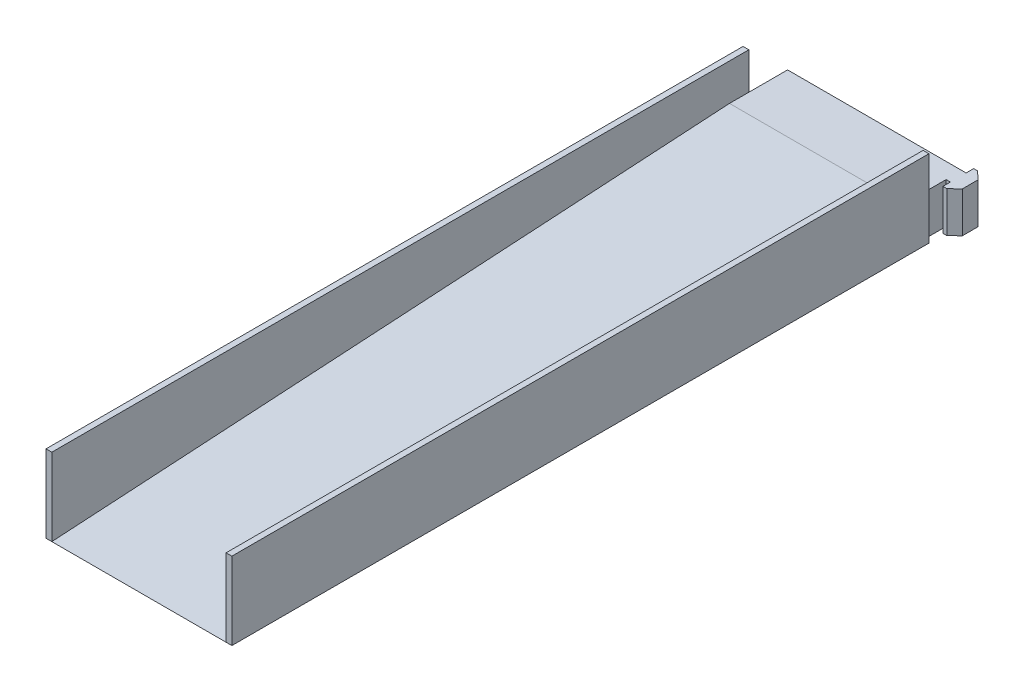
ISO-10303-21;
HEADER;
FILE_DESCRIPTION(('STEP AP214'),'2;1');
FILE_NAME('part.step','',(''),(''),'','','');
FILE_SCHEMA(('AUTOMOTIVE_DESIGN { 1 0 10303 214 1 1 1 1 }'));
ENDSEC;
DATA;
#1=APPLICATION_CONTEXT('core data for automotive mechanical design processes');
#2=APPLICATION_PROTOCOL_DEFINITION('international standard','automotive_design',2000,#1);
#3=PRODUCT_CONTEXT('',#1,'mechanical');
#4=PRODUCT('Part','Part','',(#3));
#5=PRODUCT_RELATED_PRODUCT_CATEGORY('part','',(#4));
#6=PRODUCT_DEFINITION_FORMATION('','',#4);
#7=PRODUCT_DEFINITION_CONTEXT('part definition',#1,'design');
#8=PRODUCT_DEFINITION('design','',#6,#7);
#9=PRODUCT_DEFINITION_SHAPE('','',#8);
#10=(LENGTH_UNIT() NAMED_UNIT(*) SI_UNIT(.MILLI.,.METRE.));
#11=(NAMED_UNIT(*) PLANE_ANGLE_UNIT() SI_UNIT($,.RADIAN.));
#12=(NAMED_UNIT(*) SI_UNIT($,.STERADIAN.) SOLID_ANGLE_UNIT());
#13=UNCERTAINTY_MEASURE_WITH_UNIT(LENGTH_MEASURE(1.E-05),#10,'distance_accuracy_value','');
#14=(GEOMETRIC_REPRESENTATION_CONTEXT(3) GLOBAL_UNCERTAINTY_ASSIGNED_CONTEXT((#13)) GLOBAL_UNIT_ASSIGNED_CONTEXT((#10,
#11,#12)) REPRESENTATION_CONTEXT('',''));
#15=CARTESIAN_POINT('',(0.,0.,0.));
#16=DIRECTION('',(0.,0.,1.));
#17=DIRECTION('',(1.,0.,0.));
#18=AXIS2_PLACEMENT_3D('',#15,#16,#17);
#19=CARTESIAN_POINT('',(45.,21.,0.));
#20=DIRECTION('',(-1.,0.,0.));
#21=DIRECTION('',(0.,0.,1.));
#22=AXIS2_PLACEMENT_3D('',#19,#20,#21);
#23=PLANE('',#22);
#24=DIRECTION('',(0.,-1.,0.));
#25=VECTOR('',#24,1.);
#26=CARTESIAN_POINT('',(45.,40.,-170.));
#27=LINE('',#26,#25);
#28=CARTESIAN_POINT('',(45.,21.,-170.));
#29=VERTEX_POINT('',#28);
#30=CARTESIAN_POINT('',(45.,0.,-170.));
#31=VERTEX_POINT('',#30);
#32=EDGE_CURVE('E67',#29,#31,#27,.T.);
#33=ORIENTED_EDGE('',*,*,#32,.T.);
#34=DIRECTION('',(0.,0.,-1.));
#35=VECTOR('',#34,1.);
#36=CARTESIAN_POINT('',(45.,0.,0.));
#37=LINE('',#36,#35);
#38=CARTESIAN_POINT('',(45.,0.,-181.9));
#39=VERTEX_POINT('',#38);
#40=EDGE_CURVE('E328',#31,#39,#37,.T.);
#41=ORIENTED_EDGE('',*,*,#40,.T.);
#42=DIRECTION('',(0.,-1.,0.));
#43=VECTOR('',#42,1.);
#44=CARTESIAN_POINT('',(45.,21.,-181.9));
#45=LINE('',#44,#43);
#46=CARTESIAN_POINT('',(45.,21.,-181.9));
#47=VERTEX_POINT('',#46);
#48=EDGE_CURVE('E48',#47,#39,#45,.T.);
#49=ORIENTED_EDGE('',*,*,#48,.F.);
#50=DIRECTION('',(0.,0.,-1.));
#51=VECTOR('',#50,1.);
#52=CARTESIAN_POINT('',(45.,21.,0.));
#53=LINE('',#52,#51);
#54=EDGE_CURVE('E62',#29,#47,#53,.T.);
#55=ORIENTED_EDGE('',*,*,#54,.F.);
#56=EDGE_LOOP('',(#33,#41,#49,#55));
#57=FACE_BOUND('',#56,.T.);
#58=ADVANCED_FACE('F45',(#57),#23,.F.);
#59=CARTESIAN_POINT('',(0.,21.,-181.9));
#60=DIRECTION('',(0.,0.,1.));
#61=DIRECTION('',(1.,0.,0.));
#62=AXIS2_PLACEMENT_3D('',#59,#60,#61);
#63=PLANE('',#62);
#64=DIRECTION('',(-1.,0.,0.));
#65=VECTOR('',#64,1.);
#66=CARTESIAN_POINT('',(0.,0.,-181.9));
#67=LINE('',#66,#65);
#68=CARTESIAN_POINT('',(47.2,0.,-181.9));
#69=VERTEX_POINT('',#68);
#70=EDGE_CURVE('E331',#69,#39,#67,.T.);
#71=ORIENTED_EDGE('',*,*,#70,.F.);
#72=DIRECTION('',(0.,-1.,0.));
#73=VECTOR('',#72,1.);
#74=CARTESIAN_POINT('',(47.2,21.,-181.9));
#75=LINE('',#74,#73);
#76=CARTESIAN_POINT('',(47.2,21.,-181.9));
#77=VERTEX_POINT('',#76);
#78=EDGE_CURVE('E390',#77,#69,#75,.T.);
#79=ORIENTED_EDGE('',*,*,#78,.F.);
#80=DIRECTION('',(-1.,0.,0.));
#81=VECTOR('',#80,1.);
#82=CARTESIAN_POINT('',(0.,21.,-181.9));
#83=LINE('',#82,#81);
#84=EDGE_CURVE('E287',#77,#47,#83,.T.);
#85=ORIENTED_EDGE('',*,*,#84,.T.);
#86=ORIENTED_EDGE('',*,*,#48,.T.);
#87=EDGE_LOOP('',(#71,#79,#85,#86));
#88=FACE_BOUND('',#87,.T.);
#89=ADVANCED_FACE('F398',(#88),#63,.T.);
#90=CARTESIAN_POINT('',(47.2000000000032,21.,-8.23939100036334E-13));
#91=DIRECTION('',(-1.,0.,0.));
#92=DIRECTION('',(0.,0.,1.));
#93=AXIS2_PLACEMENT_3D('',#90,#91,#92);
#94=PLANE('',#93);
#95=DIRECTION('',(0.,0.,-1.));
#96=VECTOR('',#95,1.);
#97=CARTESIAN_POINT('',(47.2000000000032,0.,-8.23939100036334E-13));
#98=LINE('',#97,#96);
#99=CARTESIAN_POINT('',(47.2000000000001,0.,-178.));
#100=VERTEX_POINT('',#99);
#101=EDGE_CURVE('E335',#100,#69,#98,.T.);
#102=ORIENTED_EDGE('',*,*,#101,.F.);
#103=DIRECTION('',(0.,-1.,0.));
#104=VECTOR('',#103,1.);
#105=CARTESIAN_POINT('',(47.2000000000001,21.,-178.));
#106=LINE('',#105,#104);
#107=CARTESIAN_POINT('',(47.2000000000001,21.,-178.));
#108=VERTEX_POINT('',#107);
#109=EDGE_CURVE('E388',#108,#100,#106,.T.);
#110=ORIENTED_EDGE('',*,*,#109,.F.);
#111=DIRECTION('',(0.,0.,-1.));
#112=VECTOR('',#111,1.);
#113=CARTESIAN_POINT('',(47.2000000000032,21.,-8.23939100036334E-13));
#114=LINE('',#113,#112);
#115=EDGE_CURVE('E291',#108,#77,#114,.T.);
#116=ORIENTED_EDGE('',*,*,#115,.T.);
#117=ORIENTED_EDGE('',*,*,#78,.T.);
#118=EDGE_LOOP('',(#102,#110,#116,#117));
#119=FACE_BOUND('',#118,.T.);
#120=ADVANCED_FACE('F405',(#119),#94,.T.);
#121=CARTESIAN_POINT('',(-4.84362005841364E-12,21.,-177.999999999999));
#122=DIRECTION('',(0.,0.,1.));
#123=DIRECTION('',(1.,0.,0.));
#124=AXIS2_PLACEMENT_3D('',#121,#122,#123);
#125=PLANE('',#124);
#126=DIRECTION('',(-1.,0.,0.));
#127=VECTOR('',#126,1.);
#128=CARTESIAN_POINT('',(-4.84362005841364E-12,0.,-177.999999999999));
#129=LINE('',#128,#127);
#130=CARTESIAN_POINT('',(49.2400000000001,0.,-178.));
#131=VERTEX_POINT('',#130);
#132=EDGE_CURVE('E339',#131,#100,#129,.T.);
#133=ORIENTED_EDGE('',*,*,#132,.F.);
#134=DIRECTION('',(0.,-1.,0.));
#135=VECTOR('',#134,1.);
#136=CARTESIAN_POINT('',(49.2400000000001,21.,-178.));
#137=LINE('',#136,#135);
#138=CARTESIAN_POINT('',(49.2400000000001,21.,-178.));
#139=VERTEX_POINT('',#138);
#140=EDGE_CURVE('E385',#139,#131,#137,.T.);
#141=ORIENTED_EDGE('',*,*,#140,.F.);
#142=DIRECTION('',(-1.,0.,0.));
#143=VECTOR('',#142,1.);
#144=CARTESIAN_POINT('',(-4.84362005841364E-12,21.,-177.999999999999));
#145=LINE('',#144,#143);
#146=EDGE_CURVE('E295',#139,#108,#145,.T.);
#147=ORIENTED_EDGE('',*,*,#146,.T.);
#148=ORIENTED_EDGE('',*,*,#109,.T.);
#149=EDGE_LOOP('',(#133,#141,#147,#148));
#150=FACE_BOUND('',#149,.T.);
#151=ADVANCED_FACE('F413',(#150),#125,.T.);
#152=CARTESIAN_POINT('',(-65.549273033323,21.,-69.0840114319663));
#153=DIRECTION('',(0.688304815664151,0.,0.725421588273701));
#154=DIRECTION('',(0.725421588273701,0.,-0.688304815664151));
#155=AXIS2_PLACEMENT_3D('',#152,#153,#154);
#156=PLANE('',#155);
#157=DIRECTION('',(-0.725421588273701,0.,0.688304815664151));
#158=VECTOR('',#157,1.);
#159=CARTESIAN_POINT('',(-65.549273033323,0.,-69.0840114319663));
#160=LINE('',#159,#158);
#161=CARTESIAN_POINT('',(53.3524149839237,0.,-181.902));
#162=VERTEX_POINT('',#161);
#163=EDGE_CURVE('E344',#162,#131,#160,.T.);
#164=ORIENTED_EDGE('',*,*,#163,.F.);
#165=DIRECTION('',(0.,-1.,0.));
#166=VECTOR('',#165,1.);
#167=CARTESIAN_POINT('',(53.3524149839237,21.,-181.902));
#168=LINE('',#167,#166);
#169=CARTESIAN_POINT('',(53.3524149839237,21.,-181.902));
#170=VERTEX_POINT('',#169);
#171=EDGE_CURVE('E382',#170,#162,#168,.T.);
#172=ORIENTED_EDGE('',*,*,#171,.F.);
#173=DIRECTION('',(-0.725421588273701,0.,0.688304815664151));
#174=VECTOR('',#173,1.);
#175=CARTESIAN_POINT('',(-65.549273033323,21.,-69.0840114319663));
#176=LINE('',#175,#174);
#177=EDGE_CURVE('E300',#170,#139,#176,.T.);
#178=ORIENTED_EDGE('',*,*,#177,.T.);
#179=ORIENTED_EDGE('',*,*,#140,.T.);
#180=EDGE_LOOP('',(#164,#172,#178,#179));
#181=FACE_BOUND('',#180,.T.);
#182=ADVANCED_FACE('F416',(#181),#156,.T.);
#183=CARTESIAN_POINT('',(53.3524149839268,21.,-9.14542359413781E-13));
#184=DIRECTION('',(1.,0.,0.));
#185=DIRECTION('',(0.,0.,-1.));
#186=AXIS2_PLACEMENT_3D('',#183,#184,#185);
#187=PLANE('',#186);
#188=DIRECTION('',(0.,0.,1.));
#189=VECTOR('',#188,1.);
#190=CARTESIAN_POINT('',(53.3524149839268,0.,-9.14542359413781E-13));
#191=LINE('',#190,#189);
#192=CARTESIAN_POINT('',(53.3524149839235,0.,-189.998));
#193=VERTEX_POINT('',#192);
#194=EDGE_CURVE('E348',#193,#162,#191,.T.);
#195=ORIENTED_EDGE('',*,*,#194,.F.);
#196=DIRECTION('',(0.,-1.,0.));
#197=VECTOR('',#196,1.);
#198=CARTESIAN_POINT('',(53.3524149839235,21.,-189.998));
#199=LINE('',#198,#197);
#200=CARTESIAN_POINT('',(53.3524149839235,21.,-189.998));
#201=VERTEX_POINT('',#200);
#202=EDGE_CURVE('E379',#201,#193,#199,.T.);
#203=ORIENTED_EDGE('',*,*,#202,.F.);
#204=DIRECTION('',(0.,0.,1.));
#205=VECTOR('',#204,1.);
#206=CARTESIAN_POINT('',(53.3524149839268,21.,-9.14542359413781E-13));
#207=LINE('',#206,#205);
#208=EDGE_CURVE('E304',#201,#170,#207,.T.);
#209=ORIENTED_EDGE('',*,*,#208,.T.);
#210=ORIENTED_EDGE('',*,*,#171,.T.);
#211=EDGE_LOOP('',(#195,#203,#209,#210));
#212=FACE_BOUND('',#211,.T.);
#213=ADVANCED_FACE('F421',(#212),#187,.T.);
#214=CARTESIAN_POINT('',(120.144552054951,21.,-126.623335752843));
#215=DIRECTION('',(0.688304815664126,0.,-0.725421588273725));
#216=DIRECTION('',(-0.725421588273725,0.,-0.688304815664126));
#217=AXIS2_PLACEMENT_3D('',#214,#215,#216);
#218=PLANE('',#217);
#219=DIRECTION('',(0.725421588273725,0.,0.688304815664126));
#220=VECTOR('',#219,1.);
#221=CARTESIAN_POINT('',(120.144552054951,0.,-126.623335752843));
#222=LINE('',#221,#220);
#223=CARTESIAN_POINT('',(49.2399999999998,0.,-193.9));
#224=VERTEX_POINT('',#223);
#225=EDGE_CURVE('E352',#224,#193,#222,.T.);
#226=ORIENTED_EDGE('',*,*,#225,.F.);
#227=DIRECTION('',(0.,-1.,0.));
#228=VECTOR('',#227,1.);
#229=CARTESIAN_POINT('',(49.2399999999998,21.,-193.9));
#230=LINE('',#229,#228);
#231=CARTESIAN_POINT('',(49.2399999999998,21.,-193.9));
#232=VERTEX_POINT('',#231);
#233=EDGE_CURVE('E376',#232,#224,#230,.T.);
#234=ORIENTED_EDGE('',*,*,#233,.F.);
#235=DIRECTION('',(0.725421588273725,0.,0.688304815664126));
#236=VECTOR('',#235,1.);
#237=CARTESIAN_POINT('',(120.144552054951,21.,-126.623335752843));
#238=LINE('',#237,#236);
#239=EDGE_CURVE('E308',#232,#201,#238,.T.);
#240=ORIENTED_EDGE('',*,*,#239,.T.);
#241=ORIENTED_EDGE('',*,*,#202,.T.);
#242=EDGE_LOOP('',(#226,#234,#240,#241));
#243=FACE_BOUND('',#242,.T.);
#244=ADVANCED_FACE('F424',(#243),#218,.T.);
#245=CARTESIAN_POINT('',(-2.63814025091688E-12,21.,-193.899999999999));
#246=DIRECTION('',(0.,0.,-1.));
#247=DIRECTION('',(-1.,0.,0.));
#248=AXIS2_PLACEMENT_3D('',#245,#246,#247);
#249=PLANE('',#248);
#250=DIRECTION('',(1.,0.,0.));
#251=VECTOR('',#250,1.);
#252=CARTESIAN_POINT('',(-2.63814025091688E-12,0.,-193.899999999999));
#253=LINE('',#252,#251);
#254=CARTESIAN_POINT('',(47.1999999999998,0.,-193.9));
#255=VERTEX_POINT('',#254);
#256=EDGE_CURVE('E356',#255,#224,#253,.T.);
#257=ORIENTED_EDGE('',*,*,#256,.F.);
#258=DIRECTION('',(0.,-1.,0.));
#259=VECTOR('',#258,1.);
#260=CARTESIAN_POINT('',(47.1999999999998,21.,-193.9));
#261=LINE('',#260,#259);
#262=CARTESIAN_POINT('',(47.1999999999998,21.,-193.9));
#263=VERTEX_POINT('',#262);
#264=EDGE_CURVE('E373',#263,#255,#261,.T.);
#265=ORIENTED_EDGE('',*,*,#264,.F.);
#266=DIRECTION('',(1.,0.,0.));
#267=VECTOR('',#266,1.);
#268=CARTESIAN_POINT('',(-2.63814025091688E-12,21.,-193.899999999999));
#269=LINE('',#268,#267);
#270=EDGE_CURVE('E312',#263,#232,#269,.T.);
#271=ORIENTED_EDGE('',*,*,#270,.T.);
#272=ORIENTED_EDGE('',*,*,#233,.T.);
#273=EDGE_LOOP('',(#257,#265,#271,#272));
#274=FACE_BOUND('',#273,.T.);
#275=ADVANCED_FACE('F430',(#274),#249,.T.);
#276=CARTESIAN_POINT('',(47.1999999999999,0.,-190.));
#277=VERTEX_POINT('',#276);
#278=EDGE_CURVE('E340',#277,#255,#98,.T.);
#279=ORIENTED_EDGE('',*,*,#278,.F.);
#280=DIRECTION('',(0.,-1.,0.));
#281=VECTOR('',#280,1.);
#282=CARTESIAN_POINT('',(47.1999999999999,21.,-190.));
#283=LINE('',#282,#281);
#284=CARTESIAN_POINT('',(47.1999999999999,21.,-190.));
#285=VERTEX_POINT('',#284);
#286=EDGE_CURVE('E370',#285,#277,#283,.T.);
#287=ORIENTED_EDGE('',*,*,#286,.F.);
#288=EDGE_CURVE('E296',#285,#263,#114,.T.);
#289=ORIENTED_EDGE('',*,*,#288,.T.);
#290=ORIENTED_EDGE('',*,*,#264,.T.);
#291=EDGE_LOOP('',(#279,#287,#289,#290));
#292=FACE_BOUND('',#291,.T.);
#293=ADVANCED_FACE('F434',(#292),#94,.T.);
#294=CARTESIAN_POINT('',(0.,21.,-190.));
#295=DIRECTION('',(0.,0.,-1.));
#296=DIRECTION('',(-1.,0.,0.));
#297=AXIS2_PLACEMENT_3D('',#294,#295,#296);
#298=PLANE('',#297);
#299=DIRECTION('',(1.,0.,0.));
#300=VECTOR('',#299,1.);
#301=CARTESIAN_POINT('',(0.,0.,-190.));
#302=LINE('',#301,#300);
#303=CARTESIAN_POINT('',(-45.,0.,-190.));
#304=VERTEX_POINT('',#303);
#305=EDGE_CURVE('E360',#304,#277,#302,.T.);
#306=ORIENTED_EDGE('',*,*,#305,.F.);
#307=DIRECTION('',(0.,-1.,0.));
#308=VECTOR('',#307,1.);
#309=CARTESIAN_POINT('',(-45.,21.,-190.));
#310=LINE('',#309,#308);
#311=CARTESIAN_POINT('',(-45.,21.,-190.));
#312=VERTEX_POINT('',#311);
#313=EDGE_CURVE('E325',#312,#304,#310,.T.);
#314=ORIENTED_EDGE('',*,*,#313,.F.);
#315=DIRECTION('',(1.,0.,0.));
#316=VECTOR('',#315,1.);
#317=CARTESIAN_POINT('',(0.,21.,-190.));
#318=LINE('',#317,#316);
#319=EDGE_CURVE('E316',#312,#285,#318,.T.);
#320=ORIENTED_EDGE('',*,*,#319,.T.);
#321=ORIENTED_EDGE('',*,*,#286,.T.);
#322=EDGE_LOOP('',(#306,#314,#320,#321));
#323=FACE_BOUND('',#322,.T.);
#324=ADVANCED_FACE('F444',(#323),#298,.T.);
#325=CARTESIAN_POINT('',(-45.,21.,0.));
#326=DIRECTION('',(-1.,0.,0.));
#327=DIRECTION('',(0.,0.,1.));
#328=AXIS2_PLACEMENT_3D('',#325,#326,#327);
#329=PLANE('',#328);
#330=DIRECTION('',(0.,-1.,0.));
#331=VECTOR('',#330,1.);
#332=CARTESIAN_POINT('',(-45.,40.,-170.));
#333=LINE('',#332,#331);
#334=CARTESIAN_POINT('',(-45.,21.,-170.));
#335=VERTEX_POINT('',#334);
#336=CARTESIAN_POINT('',(-45.,0.,-170.));
#337=VERTEX_POINT('',#336);
#338=EDGE_CURVE('E11',#335,#337,#333,.T.);
#339=ORIENTED_EDGE('',*,*,#338,.F.);
#340=DIRECTION('',(0.,0.,-1.));
#341=VECTOR('',#340,1.);
#342=CARTESIAN_POINT('',(-45.,21.,0.));
#343=LINE('',#342,#341);
#344=EDGE_CURVE('E320',#335,#312,#343,.T.);
#345=ORIENTED_EDGE('',*,*,#344,.T.);
#346=ORIENTED_EDGE('',*,*,#313,.T.);
#347=DIRECTION('',(0.,0.,-1.));
#348=VECTOR('',#347,1.);
#349=CARTESIAN_POINT('',(-45.,0.,0.));
#350=LINE('',#349,#348);
#351=EDGE_CURVE('E364',#337,#304,#350,.T.);
#352=ORIENTED_EDGE('',*,*,#351,.F.);
#353=EDGE_LOOP('',(#339,#345,#346,#352));
#354=FACE_BOUND('',#353,.T.);
#355=ADVANCED_FACE('F499',(#354),#329,.T.);
#356=CARTESIAN_POINT('',(0.,21.,0.));
#357=DIRECTION('',(0.,1.,0.));
#358=DIRECTION('',(0.,0.,1.));
#359=AXIS2_PLACEMENT_3D('',#356,#357,#358);
#360=PLANE('',#359);
#361=DIRECTION('',(-1.,0.,0.));
#362=VECTOR('',#361,1.);
#363=CARTESIAN_POINT('',(53.3524149839237,21.,-160.));
#364=LINE('',#363,#362);
#365=CARTESIAN_POINT('',(45.,21.,-160.));
#366=VERTEX_POINT('',#365);
#367=CARTESIAN_POINT('',(-45.,21.,-160.));
#368=VERTEX_POINT('',#367);
#369=EDGE_CURVE('E277',#366,#368,#364,.T.);
#370=ORIENTED_EDGE('',*,*,#369,.F.);
#371=EDGE_CURVE('E284',#366,#29,#53,.T.);
#372=ORIENTED_EDGE('',*,*,#371,.T.);
#373=ORIENTED_EDGE('',*,*,#54,.T.);
#374=ORIENTED_EDGE('',*,*,#84,.F.);
#375=ORIENTED_EDGE('',*,*,#115,.F.);
#376=ORIENTED_EDGE('',*,*,#146,.F.);
#377=ORIENTED_EDGE('',*,*,#177,.F.);
#378=ORIENTED_EDGE('',*,*,#208,.F.);
#379=ORIENTED_EDGE('',*,*,#239,.F.);
#380=ORIENTED_EDGE('',*,*,#270,.F.);
#381=ORIENTED_EDGE('',*,*,#288,.F.);
#382=ORIENTED_EDGE('',*,*,#319,.F.);
#383=ORIENTED_EDGE('',*,*,#344,.F.);
#384=EDGE_CURVE('E321',#368,#335,#343,.T.);
#385=ORIENTED_EDGE('',*,*,#384,.F.);
#386=EDGE_LOOP('',(#370,#372,#373,#374,#375,#376,#377,#378,#379,#380,#381,#382,#383,#385));
#387=FACE_BOUND('',#386,.T.);
#388=ADVANCED_FACE('F411',(#387),#360,.T.);
#389=CARTESIAN_POINT('',(0.,0.,0.));
#390=DIRECTION('',(0.,1.,0.));
#391=DIRECTION('',(0.,0.,1.));
#392=AXIS2_PLACEMENT_3D('',#389,#390,#391);
#393=PLANE('',#392);
#394=DIRECTION('',(1.,0.,0.));
#395=VECTOR('',#394,1.);
#396=CARTESIAN_POINT('',(0.,0.,190.));
#397=LINE('',#396,#395);
#398=CARTESIAN_POINT('',(-45.,0.,190.));
#399=VERTEX_POINT('',#398);
#400=CARTESIAN_POINT('',(45.,0.,190.));
#401=VERTEX_POINT('',#400);
#402=EDGE_CURVE('E283',#399,#401,#397,.T.);
#403=ORIENTED_EDGE('',*,*,#402,.F.);
#404=DIRECTION('',(-1.,0.,0.));
#405=VECTOR('',#404,1.);
#406=CARTESIAN_POINT('',(-45.,0.,190.));
#407=LINE('',#406,#405);
#408=CARTESIAN_POINT('',(-48.,0.,190.));
#409=VERTEX_POINT('',#408);
#410=EDGE_CURVE('E228',#399,#409,#407,.T.);
#411=ORIENTED_EDGE('',*,*,#410,.T.);
#412=DIRECTION('',(0.,0.,-1.));
#413=VECTOR('',#412,1.);
#414=CARTESIAN_POINT('',(-48.,0.,-170.));
#415=LINE('',#414,#413);
#416=CARTESIAN_POINT('',(-48.,0.,-170.));
#417=VERTEX_POINT('',#416);
#418=EDGE_CURVE('E256',#409,#417,#415,.T.);
#419=ORIENTED_EDGE('',*,*,#418,.T.);
#420=DIRECTION('',(1.,0.,0.));
#421=VECTOR('',#420,1.);
#422=CARTESIAN_POINT('',(-45.,0.,-170.));
#423=LINE('',#422,#421);
#424=EDGE_CURVE('E240',#417,#337,#423,.T.);
#425=ORIENTED_EDGE('',*,*,#424,.T.);
#426=ORIENTED_EDGE('',*,*,#351,.T.);
#427=ORIENTED_EDGE('',*,*,#305,.T.);
#428=ORIENTED_EDGE('',*,*,#278,.T.);
#429=ORIENTED_EDGE('',*,*,#256,.T.);
#430=ORIENTED_EDGE('',*,*,#225,.T.);
#431=ORIENTED_EDGE('',*,*,#194,.T.);
#432=ORIENTED_EDGE('',*,*,#163,.T.);
#433=ORIENTED_EDGE('',*,*,#132,.T.);
#434=ORIENTED_EDGE('',*,*,#101,.T.);
#435=ORIENTED_EDGE('',*,*,#70,.T.);
#436=ORIENTED_EDGE('',*,*,#40,.F.);
#437=DIRECTION('',(-1.,0.,0.));
#438=VECTOR('',#437,1.);
#439=CARTESIAN_POINT('',(45.,0.,-170.));
#440=LINE('',#439,#438);
#441=CARTESIAN_POINT('',(48.,0.,-170.));
#442=VERTEX_POINT('',#441);
#443=EDGE_CURVE('E221',#442,#31,#440,.T.);
#444=ORIENTED_EDGE('',*,*,#443,.F.);
#445=DIRECTION('',(0.,0.,-1.));
#446=VECTOR('',#445,1.);
#447=CARTESIAN_POINT('',(48.,0.,-170.));
#448=LINE('',#447,#446);
#449=CARTESIAN_POINT('',(48.,0.,190.));
#450=VERTEX_POINT('',#449);
#451=EDGE_CURVE('E213',#450,#442,#448,.T.);
#452=ORIENTED_EDGE('',*,*,#451,.F.);
#453=DIRECTION('',(1.,0.,0.));
#454=VECTOR('',#453,1.);
#455=CARTESIAN_POINT('',(45.,0.,190.));
#456=LINE('',#455,#454);
#457=EDGE_CURVE('E210',#401,#450,#456,.T.);
#458=ORIENTED_EDGE('',*,*,#457,.F.);
#459=EDGE_LOOP('',(#403,#411,#419,#425,#426,#427,#428,#429,#430,#431,#432,#433,#434,#435,#436,
#444,#452,#458));
#460=FACE_BOUND('',#459,.T.);
#461=ADVANCED_FACE('F402',(#460),#393,.F.);
#462=CARTESIAN_POINT('',(53.3524149839237,0.,190.));
#463=DIRECTION('',(0.,-0.998204845465779,-0.0598922907279467));
#464=DIRECTION('',(0.,0.0598922907279467,-0.998204845465779));
#465=AXIS2_PLACEMENT_3D('',#462,#463,#464);
#466=PLANE('',#465);
#467=ORIENTED_EDGE('',*,*,#369,.T.);
#468=DIRECTION('',(0.,-0.0598922907279467,0.998204845465779));
#469=VECTOR('',#468,1.);
#470=CARTESIAN_POINT('',(-45.,0.,190.));
#471=LINE('',#470,#469);
#472=EDGE_CURVE('E265',#368,#399,#471,.T.);
#473=ORIENTED_EDGE('',*,*,#472,.T.);
#474=ORIENTED_EDGE('',*,*,#402,.T.);
#475=DIRECTION('',(0.,-0.0598922907279467,0.998204845465779));
#476=VECTOR('',#475,1.);
#477=CARTESIAN_POINT('',(45.,11.434436030291,-0.573933838182543));
#478=LINE('',#477,#476);
#479=EDGE_CURVE('E280',#366,#401,#478,.T.);
#480=ORIENTED_EDGE('',*,*,#479,.F.);
#481=EDGE_LOOP('',(#467,#473,#474,#480));
#482=FACE_BOUND('',#481,.T.);
#483=ADVANCED_FACE('F467',(#482),#466,.F.);
#484=CARTESIAN_POINT('',(-45.,40.,-170.));
#485=DIRECTION('',(1.,0.,0.));
#486=DIRECTION('',(0.,0.,-1.));
#487=AXIS2_PLACEMENT_3D('',#484,#485,#486);
#488=PLANE('',#487);
#489=ORIENTED_EDGE('',*,*,#472,.F.);
#490=ORIENTED_EDGE('',*,*,#384,.T.);
#491=CARTESIAN_POINT('',(-45.,40.,-170.));
#492=VERTEX_POINT('',#491);
#493=EDGE_CURVE('E55',#492,#335,#333,.T.);
#494=ORIENTED_EDGE('',*,*,#493,.F.);
#495=DIRECTION('',(0.,0.,1.));
#496=VECTOR('',#495,1.);
#497=CARTESIAN_POINT('',(-45.,40.,-170.));
#498=LINE('',#497,#496);
#499=CARTESIAN_POINT('',(-45.,40.,190.));
#500=VERTEX_POINT('',#499);
#501=EDGE_CURVE('E235',#492,#500,#498,.T.);
#502=ORIENTED_EDGE('',*,*,#501,.T.);
#503=DIRECTION('',(0.,-1.,0.));
#504=VECTOR('',#503,1.);
#505=CARTESIAN_POINT('',(-45.,40.,190.));
#506=LINE('',#505,#504);
#507=EDGE_CURVE('E252',#500,#399,#506,.T.);
#508=ORIENTED_EDGE('',*,*,#507,.T.);
#509=EDGE_LOOP('',(#489,#490,#494,#502,#508));
#510=FACE_BOUND('',#509,.T.);
#511=ADVANCED_FACE('F450',(#510),#488,.T.);
#512=CARTESIAN_POINT('',(-45.,40.,-170.));
#513=DIRECTION('',(0.,0.,-1.));
#514=DIRECTION('',(-1.,0.,0.));
#515=AXIS2_PLACEMENT_3D('',#512,#513,#514);
#516=PLANE('',#515);
#517=ORIENTED_EDGE('',*,*,#424,.F.);
#518=DIRECTION('',(0.,-1.,0.));
#519=VECTOR('',#518,1.);
#520=CARTESIAN_POINT('',(-48.,40.,-170.));
#521=LINE('',#520,#519);
#522=CARTESIAN_POINT('',(-48.,40.,-170.));
#523=VERTEX_POINT('',#522);
#524=EDGE_CURVE('E266',#523,#417,#521,.T.);
#525=ORIENTED_EDGE('',*,*,#524,.F.);
#526=DIRECTION('',(1.,0.,0.));
#527=VECTOR('',#526,1.);
#528=CARTESIAN_POINT('',(-45.,40.,-170.));
#529=LINE('',#528,#527);
#530=EDGE_CURVE('E248',#523,#492,#529,.T.);
#531=ORIENTED_EDGE('',*,*,#530,.T.);
#532=ORIENTED_EDGE('',*,*,#493,.T.);
#533=ORIENTED_EDGE('',*,*,#338,.T.);
#534=EDGE_LOOP('',(#517,#525,#531,#532,#533));
#535=FACE_BOUND('',#534,.T.);
#536=ADVANCED_FACE('F454',(#535),#516,.T.);
#537=CARTESIAN_POINT('',(-48.,40.,-170.));
#538=DIRECTION('',(-1.,0.,0.));
#539=DIRECTION('',(0.,0.,1.));
#540=AXIS2_PLACEMENT_3D('',#537,#538,#539);
#541=PLANE('',#540);
#542=ORIENTED_EDGE('',*,*,#418,.F.);
#543=DIRECTION('',(0.,-1.,0.));
#544=VECTOR('',#543,1.);
#545=CARTESIAN_POINT('',(-48.,40.,190.));
#546=LINE('',#545,#544);
#547=CARTESIAN_POINT('',(-48.,40.,190.));
#548=VERTEX_POINT('',#547);
#549=EDGE_CURVE('E269',#548,#409,#546,.T.);
#550=ORIENTED_EDGE('',*,*,#549,.F.);
#551=DIRECTION('',(0.,0.,-1.));
#552=VECTOR('',#551,1.);
#553=CARTESIAN_POINT('',(-48.,40.,-170.));
#554=LINE('',#553,#552);
#555=EDGE_CURVE('E244',#548,#523,#554,.T.);
#556=ORIENTED_EDGE('',*,*,#555,.T.);
#557=ORIENTED_EDGE('',*,*,#524,.T.);
#558=EDGE_LOOP('',(#542,#550,#556,#557));
#559=FACE_BOUND('',#558,.T.);
#560=ADVANCED_FACE('F594',(#559),#541,.T.);
#561=CARTESIAN_POINT('',(-45.,40.,190.));
#562=DIRECTION('',(0.,0.,1.));
#563=DIRECTION('',(1.,0.,0.));
#564=AXIS2_PLACEMENT_3D('',#561,#562,#563);
#565=PLANE('',#564);
#566=ORIENTED_EDGE('',*,*,#410,.F.);
#567=ORIENTED_EDGE('',*,*,#507,.F.);
#568=DIRECTION('',(-1.,0.,0.));
#569=VECTOR('',#568,1.);
#570=CARTESIAN_POINT('',(-45.,40.,190.));
#571=LINE('',#570,#569);
#572=EDGE_CURVE('E239',#500,#548,#571,.T.);
#573=ORIENTED_EDGE('',*,*,#572,.T.);
#574=ORIENTED_EDGE('',*,*,#549,.T.);
#575=EDGE_LOOP('',(#566,#567,#573,#574));
#576=FACE_BOUND('',#575,.T.);
#577=ADVANCED_FACE('F462',(#576),#565,.T.);
#578=CARTESIAN_POINT('',(0.,40.,0.));
#579=DIRECTION('',(0.,-1.,0.));
#580=DIRECTION('',(0.,0.,-1.));
#581=AXIS2_PLACEMENT_3D('',#578,#579,#580);
#582=PLANE('',#581);
#583=ORIENTED_EDGE('',*,*,#501,.F.);
#584=ORIENTED_EDGE('',*,*,#530,.F.);
#585=ORIENTED_EDGE('',*,*,#555,.F.);
#586=ORIENTED_EDGE('',*,*,#572,.F.);
#587=EDGE_LOOP('',(#583,#584,#585,#586));
#588=FACE_BOUND('',#587,.T.);
#589=ADVANCED_FACE('F458',(#588),#582,.F.);
#590=CARTESIAN_POINT('',(45.,40.,-170.));
#591=DIRECTION('',(1.,0.,0.));
#592=DIRECTION('',(0.,0.,-1.));
#593=AXIS2_PLACEMENT_3D('',#590,#591,#592);
#594=PLANE('',#593);
#595=ORIENTED_EDGE('',*,*,#371,.F.);
#596=ORIENTED_EDGE('',*,*,#479,.T.);
#597=DIRECTION('',(0.,-1.,0.));
#598=VECTOR('',#597,1.);
#599=CARTESIAN_POINT('',(45.,40.,190.));
#600=LINE('',#599,#598);
#601=CARTESIAN_POINT('',(45.,40.,190.));
#602=VERTEX_POINT('',#601);
#603=EDGE_CURVE('E208',#602,#401,#600,.T.);
#604=ORIENTED_EDGE('',*,*,#603,.F.);
#605=DIRECTION('',(0.,0.,1.));
#606=VECTOR('',#605,1.);
#607=CARTESIAN_POINT('',(45.,40.,-170.));
#608=LINE('',#607,#606);
#609=CARTESIAN_POINT('',(45.,40.,-170.));
#610=VERTEX_POINT('',#609);
#611=EDGE_CURVE('E187',#610,#602,#608,.T.);
#612=ORIENTED_EDGE('',*,*,#611,.F.);
#613=EDGE_CURVE('E197',#610,#29,#27,.T.);
#614=ORIENTED_EDGE('',*,*,#613,.T.);
#615=EDGE_LOOP('',(#595,#596,#604,#612,#614));
#616=FACE_BOUND('',#615,.T.);
#617=ADVANCED_FACE('F205',(#616),#594,.F.);
#618=CARTESIAN_POINT('',(45.,40.,190.));
#619=DIRECTION('',(0.,0.,-1.));
#620=DIRECTION('',(-1.,0.,0.));
#621=AXIS2_PLACEMENT_3D('',#618,#619,#620);
#622=PLANE('',#621);
#623=ORIENTED_EDGE('',*,*,#457,.T.);
#624=DIRECTION('',(0.,-1.,0.));
#625=VECTOR('',#624,1.);
#626=CARTESIAN_POINT('',(48.,40.,190.));
#627=LINE('',#626,#625);
#628=CARTESIAN_POINT('',(48.,40.,190.));
#629=VERTEX_POINT('',#628);
#630=EDGE_CURVE('E229',#629,#450,#627,.T.);
#631=ORIENTED_EDGE('',*,*,#630,.F.);
#632=DIRECTION('',(1.,0.,0.));
#633=VECTOR('',#632,1.);
#634=CARTESIAN_POINT('',(45.,40.,190.));
#635=LINE('',#634,#633);
#636=EDGE_CURVE('E218',#602,#629,#635,.T.);
#637=ORIENTED_EDGE('',*,*,#636,.F.);
#638=ORIENTED_EDGE('',*,*,#603,.T.);
#639=EDGE_LOOP('',(#623,#631,#637,#638));
#640=FACE_BOUND('',#639,.T.);
#641=ADVANCED_FACE('F527',(#640),#622,.F.);
#642=CARTESIAN_POINT('',(48.,40.,-170.));
#643=DIRECTION('',(-1.,0.,0.));
#644=DIRECTION('',(0.,0.,1.));
#645=AXIS2_PLACEMENT_3D('',#642,#643,#644);
#646=PLANE('',#645);
#647=ORIENTED_EDGE('',*,*,#451,.T.);
#648=DIRECTION('',(0.,-1.,0.));
#649=VECTOR('',#648,1.);
#650=CARTESIAN_POINT('',(48.,40.,-170.));
#651=LINE('',#650,#649);
#652=CARTESIAN_POINT('',(48.,40.,-170.));
#653=VERTEX_POINT('',#652);
#654=EDGE_CURVE('E203',#653,#442,#651,.T.);
#655=ORIENTED_EDGE('',*,*,#654,.F.);
#656=DIRECTION('',(0.,0.,-1.));
#657=VECTOR('',#656,1.);
#658=CARTESIAN_POINT('',(48.,40.,-170.));
#659=LINE('',#658,#657);
#660=EDGE_CURVE('E190',#629,#653,#659,.T.);
#661=ORIENTED_EDGE('',*,*,#660,.F.);
#662=ORIENTED_EDGE('',*,*,#630,.T.);
#663=EDGE_LOOP('',(#647,#655,#661,#662));
#664=FACE_BOUND('',#663,.T.);
#665=ADVANCED_FACE('F538',(#664),#646,.F.);
#666=CARTESIAN_POINT('',(45.,40.,-170.));
#667=DIRECTION('',(0.,0.,1.));
#668=DIRECTION('',(1.,0.,0.));
#669=AXIS2_PLACEMENT_3D('',#666,#667,#668);
#670=PLANE('',#669);
#671=ORIENTED_EDGE('',*,*,#443,.T.);
#672=ORIENTED_EDGE('',*,*,#32,.F.);
#673=ORIENTED_EDGE('',*,*,#613,.F.);
#674=DIRECTION('',(-1.,0.,0.));
#675=VECTOR('',#674,1.);
#676=CARTESIAN_POINT('',(45.,40.,-170.));
#677=LINE('',#676,#675);
#678=EDGE_CURVE('E183',#653,#610,#677,.T.);
#679=ORIENTED_EDGE('',*,*,#678,.F.);
#680=ORIENTED_EDGE('',*,*,#654,.T.);
#681=EDGE_LOOP('',(#671,#672,#673,#679,#680));
#682=FACE_BOUND('',#681,.T.);
#683=ADVANCED_FACE('F199',(#682),#670,.F.);
#684=CARTESIAN_POINT('',(0.,40.,0.));
#685=DIRECTION('',(0.,-1.,0.));
#686=DIRECTION('',(0.,0.,-1.));
#687=AXIS2_PLACEMENT_3D('',#684,#685,#686);
#688=PLANE('',#687);
#689=ORIENTED_EDGE('',*,*,#611,.T.);
#690=ORIENTED_EDGE('',*,*,#636,.T.);
#691=ORIENTED_EDGE('',*,*,#660,.T.);
#692=ORIENTED_EDGE('',*,*,#678,.T.);
#693=EDGE_LOOP('',(#689,#690,#691,#692));
#694=FACE_BOUND('',#693,.T.);
#695=ADVANCED_FACE('F185',(#694),#688,.F.);
#696=CLOSED_SHELL('',(#58,#89,#120,#151,#182,#213,#244,#275,#293,#324,#355,#388,#461,#483,#511,
#536,#560,#577,#589,#617,#641,#665,#683,#695));
#697=MANIFOLD_SOLID_BREP('B2',#696);
#698=ADVANCED_BREP_SHAPE_REPRESENTATION('',(#18,#697),#14);
#699=SHAPE_DEFINITION_REPRESENTATION(#9,#698);
ENDSEC;
END-ISO-10303-21;
